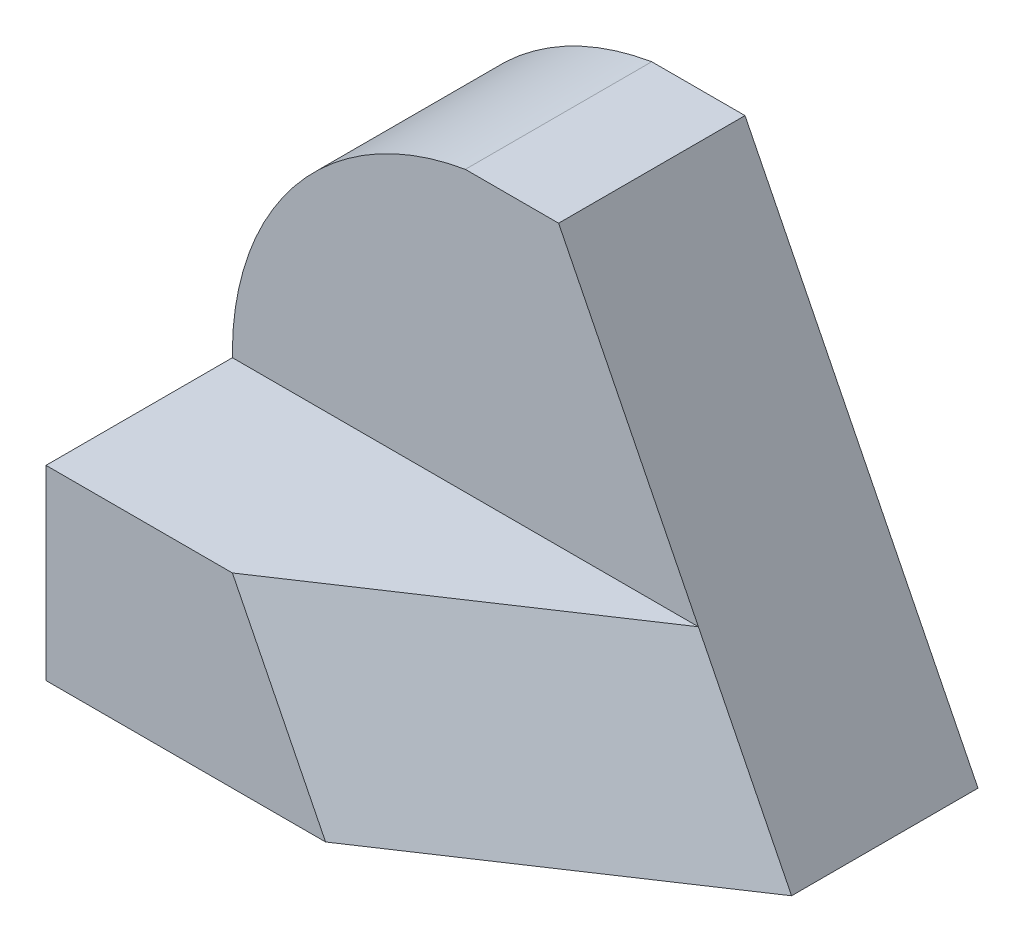
ISO-10303-21;
HEADER;
FILE_DESCRIPTION(('STEP AP214'),'2;1');
FILE_NAME('part.step','',(''),(''),'','','');
FILE_SCHEMA(('AUTOMOTIVE_DESIGN { 1 0 10303 214 1 1 1 1 }'));
ENDSEC;
DATA;
#1=APPLICATION_CONTEXT('core data for automotive mechanical design processes');
#2=APPLICATION_PROTOCOL_DEFINITION('international standard','automotive_design',2000,#1);
#3=PRODUCT_CONTEXT('',#1,'mechanical');
#4=PRODUCT('Part','Part','',(#3));
#5=PRODUCT_RELATED_PRODUCT_CATEGORY('part','',(#4));
#6=PRODUCT_DEFINITION_FORMATION('','',#4);
#7=PRODUCT_DEFINITION_CONTEXT('part definition',#1,'design');
#8=PRODUCT_DEFINITION('design','',#6,#7);
#9=PRODUCT_DEFINITION_SHAPE('','',#8);
#10=(LENGTH_UNIT() NAMED_UNIT(*) SI_UNIT(.MILLI.,.METRE.));
#11=(NAMED_UNIT(*) PLANE_ANGLE_UNIT() SI_UNIT($,.RADIAN.));
#12=(NAMED_UNIT(*) SI_UNIT($,.STERADIAN.) SOLID_ANGLE_UNIT());
#13=UNCERTAINTY_MEASURE_WITH_UNIT(LENGTH_MEASURE(1.E-05),#10,'distance_accuracy_value','');
#14=(GEOMETRIC_REPRESENTATION_CONTEXT(3) GLOBAL_UNCERTAINTY_ASSIGNED_CONTEXT((#13)) GLOBAL_UNIT_ASSIGNED_CONTEXT((#10,
#11,#12)) REPRESENTATION_CONTEXT('',''));
#15=CARTESIAN_POINT('',(0.,0.,0.));
#16=DIRECTION('',(0.,0.,1.));
#17=DIRECTION('',(1.,0.,0.));
#18=AXIS2_PLACEMENT_3D('',#15,#16,#17);
#19=CARTESIAN_POINT('',(0.,0.,2.));
#20=DIRECTION('',(0.,0.,-1.));
#21=DIRECTION('',(-1.,0.,0.));
#22=AXIS2_PLACEMENT_3D('',#19,#20,#21);
#23=PLANE('',#22);
#24=DIRECTION('',(-1.,0.,0.));
#25=VECTOR('',#24,1.);
#26=CARTESIAN_POINT('',(0.,5.,2.));
#27=LINE('',#26,#25);
#28=CARTESIAN_POINT('',(3.5,5.,2.));
#29=VERTEX_POINT('',#28);
#30=CARTESIAN_POINT('',(2.49941169548544,5.,2.));
#31=VERTEX_POINT('',#30);
#32=EDGE_CURVE('E110',#29,#31,#27,.T.);
#33=ORIENTED_EDGE('',*,*,#32,.T.);
#34=CARTESIAN_POINT('',(2.99970584774272,2.04200984430016,2.));
#35=DIRECTION('',(0.,0.,1.));
#36=DIRECTION('',(1.,0.,0.));
#37=AXIS2_PLACEMENT_3D('',#34,#35,#36);
#38=CIRCLE('',#37,3.);
#39=CARTESIAN_POINT('',(0.,2.08401968860033,2.));
#40=VERTEX_POINT('',#39);
#41=EDGE_CURVE('E99',#40,#31,#38,.F.);
#42=ORIENTED_EDGE('',*,*,#41,.F.);
#43=DIRECTION('',(0.,-1.,0.));
#44=VECTOR('',#43,1.);
#45=CARTESIAN_POINT('',(0.,0.,2.));
#46=LINE('',#45,#44);
#47=CARTESIAN_POINT('',(0.,2.,2.));
#48=VERTEX_POINT('',#47);
#49=EDGE_CURVE('E38',#40,#48,#46,.T.);
#50=ORIENTED_EDGE('',*,*,#49,.T.);
#51=DIRECTION('',(-1.,0.,0.));
#52=VECTOR('',#51,1.);
#53=CARTESIAN_POINT('',(0.,2.,2.));
#54=LINE('',#53,#52);
#55=CARTESIAN_POINT('',(5.,2.,2.));
#56=VERTEX_POINT('',#55);
#57=EDGE_CURVE('E135',#56,#48,#54,.T.);
#58=ORIENTED_EDGE('',*,*,#57,.F.);
#59=DIRECTION('',(0.447213595499958,-0.894427190999916,0.));
#60=VECTOR('',#59,1.);
#61=CARTESIAN_POINT('',(6.,0.,2.));
#62=LINE('',#61,#60);
#63=EDGE_CURVE('E174',#29,#56,#62,.T.);
#64=ORIENTED_EDGE('',*,*,#63,.F.);
#65=EDGE_LOOP('',(#33,#42,#50,#58,#64));
#66=FACE_BOUND('',#65,.T.);
#67=ADVANCED_FACE('F34',(#66),#23,.F.);
#68=CARTESIAN_POINT('',(0.,0.,2.));
#69=DIRECTION('',(1.,0.,0.));
#70=DIRECTION('',(0.,0.,-1.));
#71=AXIS2_PLACEMENT_3D('',#68,#69,#70);
#72=PLANE('',#71);
#73=ORIENTED_EDGE('',*,*,#49,.F.);
#74=DIRECTION('',(0.,0.,1.));
#75=VECTOR('',#74,1.);
#76=CARTESIAN_POINT('',(0.,2.08401968860033,-8.));
#77=LINE('',#76,#75);
#78=CARTESIAN_POINT('',(0.,2.08401968860033,0.));
#79=VERTEX_POINT('',#78);
#80=EDGE_CURVE('E96',#79,#40,#77,.T.);
#81=ORIENTED_EDGE('',*,*,#80,.F.);
#82=DIRECTION('',(0.,-1.,0.));
#83=VECTOR('',#82,1.);
#84=CARTESIAN_POINT('',(0.,0.,0.));
#85=LINE('',#84,#83);
#86=CARTESIAN_POINT('',(0.,0.,0.));
#87=VERTEX_POINT('',#86);
#88=EDGE_CURVE('E126',#79,#87,#85,.T.);
#89=ORIENTED_EDGE('',*,*,#88,.T.);
#90=DIRECTION('',(0.,0.,-1.));
#91=VECTOR('',#90,1.);
#92=CARTESIAN_POINT('',(0.,0.,2.));
#93=LINE('',#92,#91);
#94=CARTESIAN_POINT('',(0.,0.,4.));
#95=VERTEX_POINT('',#94);
#96=EDGE_CURVE('E44',#95,#87,#93,.T.);
#97=ORIENTED_EDGE('',*,*,#96,.F.);
#98=DIRECTION('',(0.,-1.,0.));
#99=VECTOR('',#98,1.);
#100=CARTESIAN_POINT('',(0.,0.,4.));
#101=LINE('',#100,#99);
#102=CARTESIAN_POINT('',(0.,2.,4.));
#103=VERTEX_POINT('',#102);
#104=EDGE_CURVE('E145',#103,#95,#101,.T.);
#105=ORIENTED_EDGE('',*,*,#104,.F.);
#106=DIRECTION('',(0.,0.,-1.));
#107=VECTOR('',#106,1.);
#108=CARTESIAN_POINT('',(0.,2.,4.));
#109=LINE('',#108,#107);
#110=EDGE_CURVE('E115',#103,#48,#109,.T.);
#111=ORIENTED_EDGE('',*,*,#110,.T.);
#112=EDGE_LOOP('',(#73,#81,#89,#97,#105,#111));
#113=FACE_BOUND('',#112,.T.);
#114=ADVANCED_FACE('F36',(#113),#72,.F.);
#115=CARTESIAN_POINT('',(0.,0.,2.));
#116=DIRECTION('',(0.,1.,0.));
#117=DIRECTION('',(0.,0.,1.));
#118=AXIS2_PLACEMENT_3D('',#115,#116,#117);
#119=PLANE('',#118);
#120=DIRECTION('',(0.,0.,-1.));
#121=VECTOR('',#120,1.);
#122=CARTESIAN_POINT('',(6.,0.,2.));
#123=LINE('',#122,#121);
#124=CARTESIAN_POINT('',(6.,0.,2.));
#125=VERTEX_POINT('',#124);
#126=CARTESIAN_POINT('',(6.,0.,0.));
#127=VERTEX_POINT('',#126);
#128=EDGE_CURVE('E117',#125,#127,#123,.T.);
#129=ORIENTED_EDGE('',*,*,#128,.F.);
#130=DIRECTION('',(-0.832050294337844,0.,0.554700196225229));
#131=VECTOR('',#130,1.);
#132=CARTESIAN_POINT('',(6.,0.,2.));
#133=LINE('',#132,#131);
#134=CARTESIAN_POINT('',(3.,0.,4.));
#135=VERTEX_POINT('',#134);
#136=EDGE_CURVE('E160',#125,#135,#133,.T.);
#137=ORIENTED_EDGE('',*,*,#136,.T.);
#138=DIRECTION('',(1.,0.,0.));
#139=VECTOR('',#138,1.);
#140=CARTESIAN_POINT('',(6.,0.,4.));
#141=LINE('',#140,#139);
#142=EDGE_CURVE('E138',#95,#135,#141,.T.);
#143=ORIENTED_EDGE('',*,*,#142,.F.);
#144=ORIENTED_EDGE('',*,*,#96,.T.);
#145=DIRECTION('',(1.,0.,0.));
#146=VECTOR('',#145,1.);
#147=CARTESIAN_POINT('',(0.,0.,0.));
#148=LINE('',#147,#146);
#149=EDGE_CURVE('E120',#87,#127,#148,.T.);
#150=ORIENTED_EDGE('',*,*,#149,.T.);
#151=EDGE_LOOP('',(#129,#137,#143,#144,#150));
#152=FACE_BOUND('',#151,.T.);
#153=ADVANCED_FACE('F188',(#152),#119,.F.);
#154=CARTESIAN_POINT('',(0.,5.,2.));
#155=DIRECTION('',(0.,-1.,0.));
#156=DIRECTION('',(0.,0.,-1.));
#157=AXIS2_PLACEMENT_3D('',#154,#155,#156);
#158=PLANE('',#157);
#159=DIRECTION('',(-1.,0.,0.));
#160=VECTOR('',#159,1.);
#161=CARTESIAN_POINT('',(0.,5.,0.));
#162=LINE('',#161,#160);
#163=CARTESIAN_POINT('',(3.5,5.,0.));
#164=VERTEX_POINT('',#163);
#165=CARTESIAN_POINT('',(2.49941169548544,5.,0.));
#166=VERTEX_POINT('',#165);
#167=EDGE_CURVE('E116',#164,#166,#162,.T.);
#168=ORIENTED_EDGE('',*,*,#167,.T.);
#169=DIRECTION('',(0.,0.,1.));
#170=VECTOR('',#169,1.);
#171=CARTESIAN_POINT('',(2.49941169548544,5.,-8.));
#172=LINE('',#171,#170);
#173=EDGE_CURVE('E50',#166,#31,#172,.T.);
#174=ORIENTED_EDGE('',*,*,#173,.T.);
#175=ORIENTED_EDGE('',*,*,#32,.F.);
#176=DIRECTION('',(0.,0.,1.));
#177=VECTOR('',#176,1.);
#178=CARTESIAN_POINT('',(3.5,5.,-8.));
#179=LINE('',#178,#177);
#180=EDGE_CURVE('E173',#164,#29,#179,.T.);
#181=ORIENTED_EDGE('',*,*,#180,.F.);
#182=EDGE_LOOP('',(#168,#174,#175,#181));
#183=FACE_BOUND('',#182,.T.);
#184=ADVANCED_FACE('F179',(#183),#158,.F.);
#185=CARTESIAN_POINT('',(0.,0.,0.));
#186=DIRECTION('',(0.,0.,-1.));
#187=DIRECTION('',(-1.,0.,0.));
#188=AXIS2_PLACEMENT_3D('',#185,#186,#187);
#189=PLANE('',#188);
#190=CARTESIAN_POINT('',(2.99970584774272,2.04200984430016,0.));
#191=DIRECTION('',(0.,0.,-1.));
#192=DIRECTION('',(-1.,0.,0.));
#193=AXIS2_PLACEMENT_3D('',#190,#191,#192);
#194=CIRCLE('',#193,3.);
#195=EDGE_CURVE('E12',#166,#79,#194,.F.);
#196=ORIENTED_EDGE('',*,*,#195,.F.);
#197=ORIENTED_EDGE('',*,*,#167,.F.);
#198=DIRECTION('',(-0.447213595499958,0.894427190999916,0.));
#199=VECTOR('',#198,1.);
#200=CARTESIAN_POINT('',(4.8,2.4,0.));
#201=LINE('',#200,#199);
#202=EDGE_CURVE('E171',#127,#164,#201,.T.);
#203=ORIENTED_EDGE('',*,*,#202,.F.);
#204=ORIENTED_EDGE('',*,*,#149,.F.);
#205=ORIENTED_EDGE('',*,*,#88,.F.);
#206=EDGE_LOOP('',(#196,#197,#203,#204,#205));
#207=FACE_BOUND('',#206,.T.);
#208=ADVANCED_FACE('F183',(#207),#189,.T.);
#209=CARTESIAN_POINT('',(0.,2.,4.));
#210=DIRECTION('',(0.,-1.,0.));
#211=DIRECTION('',(0.,0.,-1.));
#212=AXIS2_PLACEMENT_3D('',#209,#210,#211);
#213=PLANE('',#212);
#214=DIRECTION('',(-1.,0.,0.));
#215=VECTOR('',#214,1.);
#216=CARTESIAN_POINT('',(0.,2.,4.));
#217=LINE('',#216,#215);
#218=CARTESIAN_POINT('',(2.,2.,4.));
#219=VERTEX_POINT('',#218);
#220=EDGE_CURVE('E140',#219,#103,#217,.T.);
#221=ORIENTED_EDGE('',*,*,#220,.F.);
#222=DIRECTION('',(0.832050294337844,0.,-0.554700196225229));
#223=VECTOR('',#222,1.);
#224=CARTESIAN_POINT('',(2.,2.,4.));
#225=LINE('',#224,#223);
#226=EDGE_CURVE('E58',#219,#56,#225,.T.);
#227=ORIENTED_EDGE('',*,*,#226,.T.);
#228=ORIENTED_EDGE('',*,*,#57,.T.);
#229=ORIENTED_EDGE('',*,*,#110,.F.);
#230=EDGE_LOOP('',(#221,#227,#228,#229));
#231=FACE_BOUND('',#230,.T.);
#232=ADVANCED_FACE('F193',(#231),#213,.F.);
#233=CARTESIAN_POINT('',(0.,0.,4.));
#234=DIRECTION('',(0.,0.,-1.));
#235=DIRECTION('',(-1.,0.,0.));
#236=AXIS2_PLACEMENT_3D('',#233,#234,#235);
#237=PLANE('',#236);
#238=ORIENTED_EDGE('',*,*,#142,.T.);
#239=DIRECTION('',(-0.447213595499958,0.894427190999916,0.));
#240=VECTOR('',#239,1.);
#241=CARTESIAN_POINT('',(3.,0.,4.));
#242=LINE('',#241,#240);
#243=EDGE_CURVE('E158',#135,#219,#242,.T.);
#244=ORIENTED_EDGE('',*,*,#243,.T.);
#245=ORIENTED_EDGE('',*,*,#220,.T.);
#246=ORIENTED_EDGE('',*,*,#104,.T.);
#247=EDGE_LOOP('',(#238,#244,#245,#246));
#248=FACE_BOUND('',#247,.T.);
#249=ADVANCED_FACE('F190',(#248),#237,.F.);
#250=CARTESIAN_POINT('',(2.57142857142857,1.28571428571428,3.85714285714286));
#251=DIRECTION('',(-0.534522483824848,-0.267261241912423,-0.801783725737274));
#252=DIRECTION('',(-0.832050294337844,0.,0.554700196225228));
#253=AXIS2_PLACEMENT_3D('',#250,#251,#252);
#254=PLANE('',#253);
#255=ORIENTED_EDGE('',*,*,#226,.F.);
#256=ORIENTED_EDGE('',*,*,#243,.F.);
#257=ORIENTED_EDGE('',*,*,#136,.F.);
#258=DIRECTION('',(0.447213595499958,-0.894427190999916,0.));
#259=VECTOR('',#258,1.);
#260=CARTESIAN_POINT('',(5.,2.,2.));
#261=LINE('',#260,#259);
#262=EDGE_CURVE('E139',#56,#125,#261,.T.);
#263=ORIENTED_EDGE('',*,*,#262,.F.);
#264=EDGE_LOOP('',(#255,#256,#257,#263));
#265=FACE_BOUND('',#264,.T.);
#266=ADVANCED_FACE('F196',(#265),#254,.F.);
#267=CARTESIAN_POINT('',(6.,0.,-8.));
#268=DIRECTION('',(-0.894427190999916,-0.447213595499958,0.));
#269=DIRECTION('',(0.447213595499958,-0.894427190999916,0.));
#270=AXIS2_PLACEMENT_3D('',#267,#268,#269);
#271=PLANE('',#270);
#272=ORIENTED_EDGE('',*,*,#202,.T.);
#273=ORIENTED_EDGE('',*,*,#180,.T.);
#274=ORIENTED_EDGE('',*,*,#63,.T.);
#275=ORIENTED_EDGE('',*,*,#262,.T.);
#276=ORIENTED_EDGE('',*,*,#128,.T.);
#277=EDGE_LOOP('',(#272,#273,#274,#275,#276));
#278=FACE_BOUND('',#277,.T.);
#279=ADVANCED_FACE('F194',(#278),#271,.F.);
#280=CARTESIAN_POINT('',(2.99970584774272,2.04200984430016,-8.));
#281=DIRECTION('',(0.,0.,1.));
#282=DIRECTION('',(1.,0.,0.));
#283=AXIS2_PLACEMENT_3D('',#280,#281,#282);
#284=CYLINDRICAL_SURFACE('',#283,3.);
#285=ORIENTED_EDGE('',*,*,#195,.T.);
#286=ORIENTED_EDGE('',*,*,#80,.T.);
#287=ORIENTED_EDGE('',*,*,#41,.T.);
#288=ORIENTED_EDGE('',*,*,#173,.F.);
#289=EDGE_LOOP('',(#285,#286,#287,#288));
#290=FACE_BOUND('',#289,.T.);
#291=ADVANCED_FACE('F98',(#290),#284,.T.);
#292=CLOSED_SHELL('',(#67,#114,#153,#184,#208,#232,#249,#266,#279,#291));
#293=MANIFOLD_SOLID_BREP('B2',#292);
#294=ADVANCED_BREP_SHAPE_REPRESENTATION('',(#18,#293),#14);
#295=SHAPE_DEFINITION_REPRESENTATION(#9,#294);
ENDSEC;
END-ISO-10303-21;
